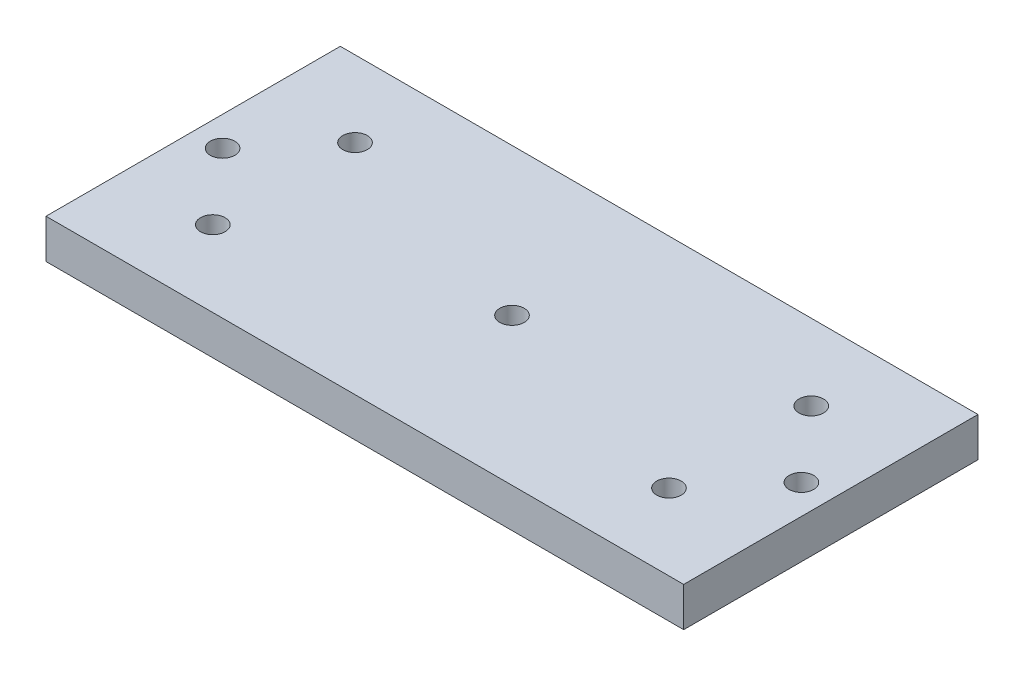
ISO-10303-21;
HEADER;
FILE_DESCRIPTION(('STEP AP214'),'2;1');
FILE_NAME('part.step','',(''),(''),'','','');
FILE_SCHEMA(('AUTOMOTIVE_DESIGN { 1 0 10303 214 1 1 1 1 }'));
ENDSEC;
DATA;
#1=APPLICATION_CONTEXT('core data for automotive mechanical design processes');
#2=APPLICATION_PROTOCOL_DEFINITION('international standard','automotive_design',2000,#1);
#3=PRODUCT_CONTEXT('',#1,'mechanical');
#4=PRODUCT('Part','Part','',(#3));
#5=PRODUCT_RELATED_PRODUCT_CATEGORY('part','',(#4));
#6=PRODUCT_DEFINITION_FORMATION('','',#4);
#7=PRODUCT_DEFINITION_CONTEXT('part definition',#1,'design');
#8=PRODUCT_DEFINITION('design','',#6,#7);
#9=PRODUCT_DEFINITION_SHAPE('','',#8);
#10=(LENGTH_UNIT() NAMED_UNIT(*) SI_UNIT(.MILLI.,.METRE.));
#11=(NAMED_UNIT(*) PLANE_ANGLE_UNIT() SI_UNIT($,.RADIAN.));
#12=(NAMED_UNIT(*) SI_UNIT($,.STERADIAN.) SOLID_ANGLE_UNIT());
#13=UNCERTAINTY_MEASURE_WITH_UNIT(LENGTH_MEASURE(1.E-05),#10,'distance_accuracy_value','');
#14=(GEOMETRIC_REPRESENTATION_CONTEXT(3) GLOBAL_UNCERTAINTY_ASSIGNED_CONTEXT((#13)) GLOBAL_UNIT_ASSIGNED_CONTEXT((#10,
#11,#12)) REPRESENTATION_CONTEXT('',''));
#15=CARTESIAN_POINT('',(0.,0.,0.));
#16=DIRECTION('',(0.,0.,1.));
#17=DIRECTION('',(1.,0.,0.));
#18=AXIS2_PLACEMENT_3D('',#15,#16,#17);
#19=CARTESIAN_POINT('',(65.,8.,-30.));
#20=DIRECTION('',(-1.,0.,0.));
#21=DIRECTION('',(0.,0.,1.));
#22=AXIS2_PLACEMENT_3D('',#19,#20,#21);
#23=PLANE('',#22);
#24=DIRECTION('',(0.,0.,-1.));
#25=VECTOR('',#24,1.);
#26=CARTESIAN_POINT('',(65.,0.,-30.));
#27=LINE('',#26,#25);
#28=CARTESIAN_POINT('',(65.,0.,30.));
#29=VERTEX_POINT('',#28);
#30=CARTESIAN_POINT('',(65.,0.,-30.));
#31=VERTEX_POINT('',#30);
#32=EDGE_CURVE('E96',#29,#31,#27,.T.);
#33=ORIENTED_EDGE('',*,*,#32,.T.);
#34=DIRECTION('',(0.,-1.,0.));
#35=VECTOR('',#34,1.);
#36=CARTESIAN_POINT('',(65.,8.,-30.));
#37=LINE('',#36,#35);
#38=CARTESIAN_POINT('',(65.,8.,-30.));
#39=VERTEX_POINT('',#38);
#40=EDGE_CURVE('E11',#39,#31,#37,.T.);
#41=ORIENTED_EDGE('',*,*,#40,.F.);
#42=DIRECTION('',(0.,0.,-1.));
#43=VECTOR('',#42,1.);
#44=CARTESIAN_POINT('',(65.,8.,-30.));
#45=LINE('',#44,#43);
#46=CARTESIAN_POINT('',(65.,8.,30.));
#47=VERTEX_POINT('',#46);
#48=EDGE_CURVE('E84',#47,#39,#45,.T.);
#49=ORIENTED_EDGE('',*,*,#48,.F.);
#50=DIRECTION('',(0.,-1.,0.));
#51=VECTOR('',#50,1.);
#52=CARTESIAN_POINT('',(65.,8.,30.));
#53=LINE('',#52,#51);
#54=EDGE_CURVE('E92',#47,#29,#53,.T.);
#55=ORIENTED_EDGE('',*,*,#54,.T.);
#56=EDGE_LOOP('',(#33,#41,#49,#55));
#57=FACE_BOUND('',#56,.T.);
#58=ADVANCED_FACE('F33',(#57),#23,.F.);
#59=CARTESIAN_POINT('',(-65.,8.,-30.));
#60=DIRECTION('',(0.,0.,1.));
#61=DIRECTION('',(1.,0.,0.));
#62=AXIS2_PLACEMENT_3D('',#59,#60,#61);
#63=PLANE('',#62);
#64=DIRECTION('',(-1.,0.,0.));
#65=VECTOR('',#64,1.);
#66=CARTESIAN_POINT('',(-65.,0.,-30.));
#67=LINE('',#66,#65);
#68=CARTESIAN_POINT('',(-65.,0.,-30.));
#69=VERTEX_POINT('',#68);
#70=EDGE_CURVE('E88',#31,#69,#67,.T.);
#71=ORIENTED_EDGE('',*,*,#70,.T.);
#72=DIRECTION('',(0.,-1.,0.));
#73=VECTOR('',#72,1.);
#74=CARTESIAN_POINT('',(-65.,8.,-30.));
#75=LINE('',#74,#73);
#76=CARTESIAN_POINT('',(-65.,8.,-30.));
#77=VERTEX_POINT('',#76);
#78=EDGE_CURVE('E41',#77,#69,#75,.T.);
#79=ORIENTED_EDGE('',*,*,#78,.F.);
#80=DIRECTION('',(-1.,0.,0.));
#81=VECTOR('',#80,1.);
#82=CARTESIAN_POINT('',(-65.,8.,-30.));
#83=LINE('',#82,#81);
#84=EDGE_CURVE('E79',#39,#77,#83,.T.);
#85=ORIENTED_EDGE('',*,*,#84,.F.);
#86=ORIENTED_EDGE('',*,*,#40,.T.);
#87=EDGE_LOOP('',(#71,#79,#85,#86));
#88=FACE_BOUND('',#87,.T.);
#89=ADVANCED_FACE('F87',(#88),#63,.F.);
#90=CARTESIAN_POINT('',(-65.,8.,-30.));
#91=DIRECTION('',(1.,0.,0.));
#92=DIRECTION('',(0.,0.,-1.));
#93=AXIS2_PLACEMENT_3D('',#90,#91,#92);
#94=PLANE('',#93);
#95=DIRECTION('',(0.,0.,1.));
#96=VECTOR('',#95,1.);
#97=CARTESIAN_POINT('',(-65.,0.,-30.));
#98=LINE('',#97,#96);
#99=CARTESIAN_POINT('',(-65.,0.,30.));
#100=VERTEX_POINT('',#99);
#101=EDGE_CURVE('E66',#69,#100,#98,.T.);
#102=ORIENTED_EDGE('',*,*,#101,.T.);
#103=DIRECTION('',(0.,-1.,0.));
#104=VECTOR('',#103,1.);
#105=CARTESIAN_POINT('',(-65.,8.,30.));
#106=LINE('',#105,#104);
#107=CARTESIAN_POINT('',(-65.,8.,30.));
#108=VERTEX_POINT('',#107);
#109=EDGE_CURVE('E89',#108,#100,#106,.T.);
#110=ORIENTED_EDGE('',*,*,#109,.F.);
#111=DIRECTION('',(0.,0.,1.));
#112=VECTOR('',#111,1.);
#113=CARTESIAN_POINT('',(-65.,8.,-30.));
#114=LINE('',#113,#112);
#115=EDGE_CURVE('E82',#77,#108,#114,.T.);
#116=ORIENTED_EDGE('',*,*,#115,.F.);
#117=ORIENTED_EDGE('',*,*,#78,.T.);
#118=EDGE_LOOP('',(#102,#110,#116,#117));
#119=FACE_BOUND('',#118,.T.);
#120=ADVANCED_FACE('F90',(#119),#94,.F.);
#121=CARTESIAN_POINT('',(-65.,8.,30.));
#122=DIRECTION('',(0.,0.,-1.));
#123=DIRECTION('',(-1.,0.,0.));
#124=AXIS2_PLACEMENT_3D('',#121,#122,#123);
#125=PLANE('',#124);
#126=DIRECTION('',(1.,0.,0.));
#127=VECTOR('',#126,1.);
#128=CARTESIAN_POINT('',(-65.,0.,30.));
#129=LINE('',#128,#127);
#130=EDGE_CURVE('E72',#100,#29,#129,.T.);
#131=ORIENTED_EDGE('',*,*,#130,.T.);
#132=ORIENTED_EDGE('',*,*,#54,.F.);
#133=DIRECTION('',(1.,0.,0.));
#134=VECTOR('',#133,1.);
#135=CARTESIAN_POINT('',(-65.,8.,30.));
#136=LINE('',#135,#134);
#137=EDGE_CURVE('E49',#108,#47,#136,.T.);
#138=ORIENTED_EDGE('',*,*,#137,.F.);
#139=ORIENTED_EDGE('',*,*,#109,.T.);
#140=EDGE_LOOP('',(#131,#132,#138,#139));
#141=FACE_BOUND('',#140,.T.);
#142=ADVANCED_FACE('F104',(#141),#125,.F.);
#143=CARTESIAN_POINT('',(0.,8.,0.));
#144=DIRECTION('',(0.,1.,0.));
#145=DIRECTION('',(0.,0.,1.));
#146=AXIS2_PLACEMENT_3D('',#143,#144,#145);
#147=PLANE('',#146);
#148=CARTESIAN_POINT('',(-46.5,8.,-14.4999999999999));
#149=DIRECTION('',(0.,1.,0.));
#150=DIRECTION('',(0.,0.,1.));
#151=AXIS2_PLACEMENT_3D('',#148,#149,#150);
#152=CIRCLE('',#151,2.5);
#153=CARTESIAN_POINT('',(-46.5,8.,-11.9999999999999));
#154=VERTEX_POINT('',#153);
#155=EDGE_CURVE('E146',#154,#154,#152,.T.);
#156=ORIENTED_EDGE('',*,*,#155,.F.);
#157=EDGE_LOOP('',(#156));
#158=FACE_BOUND('',#157,.T.);
#159=CARTESIAN_POINT('',(-59.,8.,1.09171930754807E-13));
#160=DIRECTION('',(0.,1.,0.));
#161=DIRECTION('',(0.,0.,-1.));
#162=AXIS2_PLACEMENT_3D('',#159,#160,#161);
#163=CIRCLE('',#162,2.5);
#164=CARTESIAN_POINT('',(-59.,8.,-2.49999999999989));
#165=VERTEX_POINT('',#164);
#166=EDGE_CURVE('E140',#165,#165,#163,.T.);
#167=ORIENTED_EDGE('',*,*,#166,.F.);
#168=EDGE_LOOP('',(#167));
#169=FACE_BOUND('',#168,.T.);
#170=CARTESIAN_POINT('',(-46.5,8.,14.5000000000001));
#171=DIRECTION('',(0.,1.,0.));
#172=DIRECTION('',(0.,0.,-1.));
#173=AXIS2_PLACEMENT_3D('',#170,#171,#172);
#174=CIRCLE('',#173,2.5);
#175=CARTESIAN_POINT('',(-46.5,8.,12.0000000000001));
#176=VERTEX_POINT('',#175);
#177=EDGE_CURVE('E134',#176,#176,#174,.T.);
#178=ORIENTED_EDGE('',*,*,#177,.F.);
#179=EDGE_LOOP('',(#178));
#180=FACE_BOUND('',#179,.T.);
#181=CARTESIAN_POINT('',(46.5,8.,-14.5));
#182=DIRECTION('',(0.,1.,0.));
#183=DIRECTION('',(0.,0.,-1.));
#184=AXIS2_PLACEMENT_3D('',#181,#182,#183);
#185=CIRCLE('',#184,2.5);
#186=CARTESIAN_POINT('',(46.5,8.,-17.));
#187=VERTEX_POINT('',#186);
#188=EDGE_CURVE('E128',#187,#187,#185,.T.);
#189=ORIENTED_EDGE('',*,*,#188,.F.);
#190=EDGE_LOOP('',(#189));
#191=FACE_BOUND('',#190,.T.);
#192=CARTESIAN_POINT('',(59.,8.,0.));
#193=DIRECTION('',(0.,1.,0.));
#194=DIRECTION('',(0.,0.,1.));
#195=AXIS2_PLACEMENT_3D('',#192,#193,#194);
#196=CIRCLE('',#195,2.5);
#197=CARTESIAN_POINT('',(59.,8.,2.5));
#198=VERTEX_POINT('',#197);
#199=EDGE_CURVE('E122',#198,#198,#196,.T.);
#200=ORIENTED_EDGE('',*,*,#199,.F.);
#201=EDGE_LOOP('',(#200));
#202=FACE_BOUND('',#201,.T.);
#203=CARTESIAN_POINT('',(46.5,8.,14.5));
#204=DIRECTION('',(0.,1.,0.));
#205=DIRECTION('',(0.,0.,1.));
#206=AXIS2_PLACEMENT_3D('',#203,#204,#205);
#207=CIRCLE('',#206,2.5);
#208=CARTESIAN_POINT('',(46.5,8.,17.));
#209=VERTEX_POINT('',#208);
#210=EDGE_CURVE('E116',#209,#209,#207,.T.);
#211=ORIENTED_EDGE('',*,*,#210,.F.);
#212=EDGE_LOOP('',(#211));
#213=FACE_BOUND('',#212,.T.);
#214=CARTESIAN_POINT('',(0.,8.,0.));
#215=DIRECTION('',(0.,1.,0.));
#216=DIRECTION('',(0.,0.,1.));
#217=AXIS2_PLACEMENT_3D('',#214,#215,#216);
#218=CIRCLE('',#217,2.5);
#219=CARTESIAN_POINT('',(0.,8.,2.5));
#220=VERTEX_POINT('',#219);
#221=EDGE_CURVE('E110',#220,#220,#218,.T.);
#222=ORIENTED_EDGE('',*,*,#221,.F.);
#223=EDGE_LOOP('',(#222));
#224=FACE_BOUND('',#223,.T.);
#225=ORIENTED_EDGE('',*,*,#48,.T.);
#226=ORIENTED_EDGE('',*,*,#84,.T.);
#227=ORIENTED_EDGE('',*,*,#115,.T.);
#228=ORIENTED_EDGE('',*,*,#137,.T.);
#229=EDGE_LOOP('',(#225,#226,#227,#228));
#230=FACE_BOUND('',#229,.T.);
#231=ADVANCED_FACE('F80',(#158,#169,#180,#191,#202,#213,#224,#230),#147,.T.);
#232=CARTESIAN_POINT('',(0.,0.,0.));
#233=DIRECTION('',(0.,1.,0.));
#234=DIRECTION('',(0.,0.,1.));
#235=AXIS2_PLACEMENT_3D('',#232,#233,#234);
#236=PLANE('',#235);
#237=CARTESIAN_POINT('',(-46.5,0.,-14.4999999999999));
#238=DIRECTION('',(0.,1.,0.));
#239=DIRECTION('',(0.,0.,1.));
#240=AXIS2_PLACEMENT_3D('',#237,#238,#239);
#241=CIRCLE('',#240,2.5);
#242=CARTESIAN_POINT('',(-46.5,0.,-11.9999999999999));
#243=VERTEX_POINT('',#242);
#244=EDGE_CURVE('E143',#243,#243,#241,.T.);
#245=ORIENTED_EDGE('',*,*,#244,.T.);
#246=EDGE_LOOP('',(#245));
#247=FACE_BOUND('',#246,.T.);
#248=CARTESIAN_POINT('',(-59.,0.,1.09171930754807E-13));
#249=DIRECTION('',(0.,1.,0.));
#250=DIRECTION('',(0.,0.,-1.));
#251=AXIS2_PLACEMENT_3D('',#248,#249,#250);
#252=CIRCLE('',#251,2.5);
#253=CARTESIAN_POINT('',(-59.,0.,-2.49999999999989));
#254=VERTEX_POINT('',#253);
#255=EDGE_CURVE('E137',#254,#254,#252,.T.);
#256=ORIENTED_EDGE('',*,*,#255,.T.);
#257=EDGE_LOOP('',(#256));
#258=FACE_BOUND('',#257,.T.);
#259=CARTESIAN_POINT('',(-46.5,0.,14.5000000000001));
#260=DIRECTION('',(0.,1.,0.));
#261=DIRECTION('',(0.,0.,-1.));
#262=AXIS2_PLACEMENT_3D('',#259,#260,#261);
#263=CIRCLE('',#262,2.5);
#264=CARTESIAN_POINT('',(-46.5,0.,12.0000000000001));
#265=VERTEX_POINT('',#264);
#266=EDGE_CURVE('E131',#265,#265,#263,.T.);
#267=ORIENTED_EDGE('',*,*,#266,.T.);
#268=EDGE_LOOP('',(#267));
#269=FACE_BOUND('',#268,.T.);
#270=CARTESIAN_POINT('',(46.5,0.,-14.5));
#271=DIRECTION('',(0.,1.,0.));
#272=DIRECTION('',(0.,0.,-1.));
#273=AXIS2_PLACEMENT_3D('',#270,#271,#272);
#274=CIRCLE('',#273,2.5);
#275=CARTESIAN_POINT('',(46.5,0.,-17.));
#276=VERTEX_POINT('',#275);
#277=EDGE_CURVE('E125',#276,#276,#274,.T.);
#278=ORIENTED_EDGE('',*,*,#277,.T.);
#279=EDGE_LOOP('',(#278));
#280=FACE_BOUND('',#279,.T.);
#281=CARTESIAN_POINT('',(59.,0.,0.));
#282=DIRECTION('',(0.,1.,0.));
#283=DIRECTION('',(0.,0.,1.));
#284=AXIS2_PLACEMENT_3D('',#281,#282,#283);
#285=CIRCLE('',#284,2.5);
#286=CARTESIAN_POINT('',(59.,0.,2.5));
#287=VERTEX_POINT('',#286);
#288=EDGE_CURVE('E119',#287,#287,#285,.T.);
#289=ORIENTED_EDGE('',*,*,#288,.T.);
#290=EDGE_LOOP('',(#289));
#291=FACE_BOUND('',#290,.T.);
#292=CARTESIAN_POINT('',(46.5,0.,14.5));
#293=DIRECTION('',(0.,1.,0.));
#294=DIRECTION('',(0.,0.,1.));
#295=AXIS2_PLACEMENT_3D('',#292,#293,#294);
#296=CIRCLE('',#295,2.5);
#297=CARTESIAN_POINT('',(46.5,0.,17.));
#298=VERTEX_POINT('',#297);
#299=EDGE_CURVE('E113',#298,#298,#296,.T.);
#300=ORIENTED_EDGE('',*,*,#299,.T.);
#301=EDGE_LOOP('',(#300));
#302=FACE_BOUND('',#301,.T.);
#303=CARTESIAN_POINT('',(0.,0.,0.));
#304=DIRECTION('',(0.,1.,0.));
#305=DIRECTION('',(0.,0.,1.));
#306=AXIS2_PLACEMENT_3D('',#303,#304,#305);
#307=CIRCLE('',#306,2.5);
#308=CARTESIAN_POINT('',(0.,0.,2.5));
#309=VERTEX_POINT('',#308);
#310=EDGE_CURVE('E99',#309,#309,#307,.T.);
#311=ORIENTED_EDGE('',*,*,#310,.T.);
#312=EDGE_LOOP('',(#311));
#313=FACE_BOUND('',#312,.T.);
#314=ORIENTED_EDGE('',*,*,#32,.F.);
#315=ORIENTED_EDGE('',*,*,#130,.F.);
#316=ORIENTED_EDGE('',*,*,#101,.F.);
#317=ORIENTED_EDGE('',*,*,#70,.F.);
#318=EDGE_LOOP('',(#314,#315,#316,#317));
#319=FACE_BOUND('',#318,.T.);
#320=ADVANCED_FACE('F107',(#247,#258,#269,#280,#291,#302,#313,#319),#236,.F.);
#321=CARTESIAN_POINT('',(0.,0.,0.));
#322=DIRECTION('',(0.,1.,0.));
#323=DIRECTION('',(0.,0.,1.));
#324=AXIS2_PLACEMENT_3D('',#321,#322,#323);
#325=CYLINDRICAL_SURFACE('',#324,2.5);
#326=ORIENTED_EDGE('',*,*,#310,.F.);
#327=EDGE_LOOP('',(#326));
#328=FACE_BOUND('',#327,.T.);
#329=ORIENTED_EDGE('',*,*,#221,.T.);
#330=EDGE_LOOP('',(#329));
#331=FACE_BOUND('',#330,.T.);
#332=ADVANCED_FACE('F176',(#328,#331),#325,.F.);
#333=CARTESIAN_POINT('',(46.5,0.,14.5));
#334=DIRECTION('',(0.,1.,0.));
#335=DIRECTION('',(0.,0.,1.));
#336=AXIS2_PLACEMENT_3D('',#333,#334,#335);
#337=CYLINDRICAL_SURFACE('',#336,2.5);
#338=ORIENTED_EDGE('',*,*,#299,.F.);
#339=EDGE_LOOP('',(#338));
#340=FACE_BOUND('',#339,.T.);
#341=ORIENTED_EDGE('',*,*,#210,.T.);
#342=EDGE_LOOP('',(#341));
#343=FACE_BOUND('',#342,.T.);
#344=ADVANCED_FACE('F178',(#340,#343),#337,.F.);
#345=CARTESIAN_POINT('',(59.,0.,0.));
#346=DIRECTION('',(0.,1.,0.));
#347=DIRECTION('',(0.,0.,1.));
#348=AXIS2_PLACEMENT_3D('',#345,#346,#347);
#349=CYLINDRICAL_SURFACE('',#348,2.5);
#350=ORIENTED_EDGE('',*,*,#288,.F.);
#351=EDGE_LOOP('',(#350));
#352=FACE_BOUND('',#351,.T.);
#353=ORIENTED_EDGE('',*,*,#199,.T.);
#354=EDGE_LOOP('',(#353));
#355=FACE_BOUND('',#354,.T.);
#356=ADVANCED_FACE('F185',(#352,#355),#349,.F.);
#357=CARTESIAN_POINT('',(46.5,0.,-14.5));
#358=DIRECTION('',(0.,1.,0.));
#359=DIRECTION('',(0.,0.,1.));
#360=AXIS2_PLACEMENT_3D('',#357,#358,#359);
#361=CYLINDRICAL_SURFACE('',#360,2.5);
#362=ORIENTED_EDGE('',*,*,#277,.F.);
#363=EDGE_LOOP('',(#362));
#364=FACE_BOUND('',#363,.T.);
#365=ORIENTED_EDGE('',*,*,#188,.T.);
#366=EDGE_LOOP('',(#365));
#367=FACE_BOUND('',#366,.T.);
#368=ADVANCED_FACE('F231',(#364,#367),#361,.F.);
#369=CARTESIAN_POINT('',(-46.5,0.,14.5000000000001));
#370=DIRECTION('',(0.,1.,0.));
#371=DIRECTION('',(0.,0.,1.));
#372=AXIS2_PLACEMENT_3D('',#369,#370,#371);
#373=CYLINDRICAL_SURFACE('',#372,2.5);
#374=ORIENTED_EDGE('',*,*,#266,.F.);
#375=EDGE_LOOP('',(#374));
#376=FACE_BOUND('',#375,.T.);
#377=ORIENTED_EDGE('',*,*,#177,.T.);
#378=EDGE_LOOP('',(#377));
#379=FACE_BOUND('',#378,.T.);
#380=ADVANCED_FACE('F241',(#376,#379),#373,.F.);
#381=CARTESIAN_POINT('',(-59.,0.,1.09171930754807E-13));
#382=DIRECTION('',(0.,1.,0.));
#383=DIRECTION('',(0.,0.,1.));
#384=AXIS2_PLACEMENT_3D('',#381,#382,#383);
#385=CYLINDRICAL_SURFACE('',#384,2.5);
#386=ORIENTED_EDGE('',*,*,#255,.F.);
#387=EDGE_LOOP('',(#386));
#388=FACE_BOUND('',#387,.T.);
#389=ORIENTED_EDGE('',*,*,#166,.T.);
#390=EDGE_LOOP('',(#389));
#391=FACE_BOUND('',#390,.T.);
#392=ADVANCED_FACE('F157',(#388,#391),#385,.F.);
#393=CARTESIAN_POINT('',(-46.5,0.,-14.4999999999999));
#394=DIRECTION('',(0.,1.,0.));
#395=DIRECTION('',(0.,0.,1.));
#396=AXIS2_PLACEMENT_3D('',#393,#394,#395);
#397=CYLINDRICAL_SURFACE('',#396,2.5);
#398=ORIENTED_EDGE('',*,*,#244,.F.);
#399=EDGE_LOOP('',(#398));
#400=FACE_BOUND('',#399,.T.);
#401=ORIENTED_EDGE('',*,*,#155,.T.);
#402=EDGE_LOOP('',(#401));
#403=FACE_BOUND('',#402,.T.);
#404=ADVANCED_FACE('F154',(#400,#403),#397,.F.);
#405=CLOSED_SHELL('',(#58,#89,#120,#142,#231,#320,#332,#344,#356,#368,#380,#392,#404));
#406=MANIFOLD_SOLID_BREP('B2',#405);
#407=ADVANCED_BREP_SHAPE_REPRESENTATION('',(#18,#406),#14);
#408=SHAPE_DEFINITION_REPRESENTATION(#9,#407);
ENDSEC;
END-ISO-10303-21;
